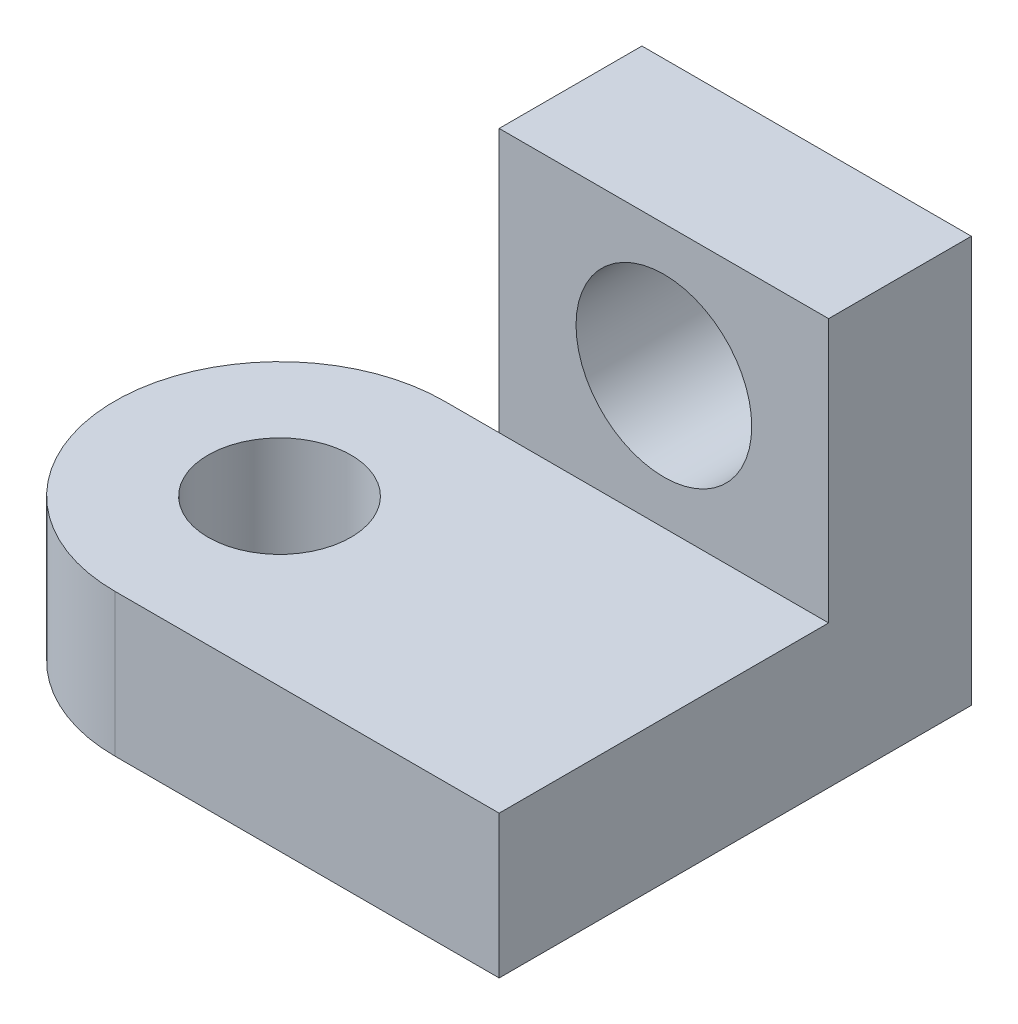
ISO-10303-21;
HEADER;
FILE_DESCRIPTION(('STEP AP214'),'2;1');
FILE_NAME('part.step','',(''),(''),'','','');
FILE_SCHEMA(('AUTOMOTIVE_DESIGN { 1 0 10303 214 1 1 1 1 }'));
ENDSEC;
DATA;
#1=APPLICATION_CONTEXT('core data for automotive mechanical design processes');
#2=APPLICATION_PROTOCOL_DEFINITION('international standard','automotive_design',2000,#1);
#3=PRODUCT_CONTEXT('',#1,'mechanical');
#4=PRODUCT('Part','Part','',(#3));
#5=PRODUCT_RELATED_PRODUCT_CATEGORY('part','',(#4));
#6=PRODUCT_DEFINITION_FORMATION('','',#4);
#7=PRODUCT_DEFINITION_CONTEXT('part definition',#1,'design');
#8=PRODUCT_DEFINITION('design','',#6,#7);
#9=PRODUCT_DEFINITION_SHAPE('','',#8);
#10=(LENGTH_UNIT() NAMED_UNIT(*) SI_UNIT(.MILLI.,.METRE.));
#11=(NAMED_UNIT(*) PLANE_ANGLE_UNIT() SI_UNIT($,.RADIAN.));
#12=(NAMED_UNIT(*) SI_UNIT($,.STERADIAN.) SOLID_ANGLE_UNIT());
#13=UNCERTAINTY_MEASURE_WITH_UNIT(LENGTH_MEASURE(1.E-05),#10,'distance_accuracy_value','');
#14=(GEOMETRIC_REPRESENTATION_CONTEXT(3) GLOBAL_UNCERTAINTY_ASSIGNED_CONTEXT((#13)) GLOBAL_UNIT_ASSIGNED_CONTEXT((#10,
#11,#12)) REPRESENTATION_CONTEXT('',''));
#15=CARTESIAN_POINT('',(0.,0.,0.));
#16=DIRECTION('',(0.,0.,1.));
#17=DIRECTION('',(1.,0.,0.));
#18=AXIS2_PLACEMENT_3D('',#15,#16,#17);
#19=CARTESIAN_POINT('',(-35.,13.,-15.));
#20=DIRECTION('',(0.,1.,0.));
#21=DIRECTION('',(0.,0.,1.));
#22=AXIS2_PLACEMENT_3D('',#19,#20,#21);
#23=PLANE('',#22);
#24=DIRECTION('',(-1.,0.,0.));
#25=VECTOR('',#24,1.);
#26=CARTESIAN_POINT('',(0.,13.,-30.));
#27=LINE('',#26,#25);
#28=CARTESIAN_POINT('',(0.,13.,-30.));
#29=VERTEX_POINT('',#28);
#30=CARTESIAN_POINT('',(-30.,13.,-30.));
#31=VERTEX_POINT('',#30);
#32=EDGE_CURVE('E163',#29,#31,#27,.T.);
#33=ORIENTED_EDGE('',*,*,#32,.T.);
#34=CARTESIAN_POINT('',(-35.,13.,-30.));
#35=VERTEX_POINT('',#34);
#36=EDGE_CURVE('E69',#31,#35,#27,.T.);
#37=ORIENTED_EDGE('',*,*,#36,.T.);
#38=CARTESIAN_POINT('',(-35.,13.,-15.));
#39=DIRECTION('',(0.,1.,0.));
#40=DIRECTION('',(0.,0.,1.));
#41=AXIS2_PLACEMENT_3D('',#38,#39,#40);
#42=CIRCLE('',#41,15.);
#43=CARTESIAN_POINT('',(-35.,13.,0.));
#44=VERTEX_POINT('',#43);
#45=EDGE_CURVE('E165',#35,#44,#42,.T.);
#46=ORIENTED_EDGE('',*,*,#45,.T.);
#47=DIRECTION('',(-1.,0.,0.));
#48=VECTOR('',#47,1.);
#49=CARTESIAN_POINT('',(0.,13.,0.));
#50=LINE('',#49,#48);
#51=CARTESIAN_POINT('',(0.,13.,0.));
#52=VERTEX_POINT('',#51);
#53=EDGE_CURVE('E167',#52,#44,#50,.T.);
#54=ORIENTED_EDGE('',*,*,#53,.F.);
#55=DIRECTION('',(0.,0.,-1.));
#56=VECTOR('',#55,1.);
#57=CARTESIAN_POINT('',(0.,13.,0.));
#58=LINE('',#57,#56);
#59=EDGE_CURVE('E170',#52,#29,#58,.T.);
#60=ORIENTED_EDGE('',*,*,#59,.T.);
#61=EDGE_LOOP('',(#33,#37,#46,#54,#60));
#62=FACE_BOUND('',#61,.T.);
#63=CARTESIAN_POINT('',(-35.,13.,-15.));
#64=DIRECTION('',(0.,1.,0.));
#65=DIRECTION('',(0.,0.,1.));
#66=AXIS2_PLACEMENT_3D('',#63,#64,#65);
#67=CIRCLE('',#66,6.5);
#68=CARTESIAN_POINT('',(-35.,13.,-8.5));
#69=VERTEX_POINT('',#68);
#70=EDGE_CURVE('E157',#69,#69,#67,.T.);
#71=ORIENTED_EDGE('',*,*,#70,.F.);
#72=EDGE_LOOP('',(#71));
#73=FACE_BOUND('',#72,.T.);
#74=ADVANCED_FACE('F54',(#62,#73),#23,.T.);
#75=CARTESIAN_POINT('',(-35.,0.,-15.));
#76=DIRECTION('',(0.,1.,0.));
#77=DIRECTION('',(0.,0.,1.));
#78=AXIS2_PLACEMENT_3D('',#75,#76,#77);
#79=PLANE('',#78);
#80=DIRECTION('',(-1.,0.,0.));
#81=VECTOR('',#80,1.);
#82=CARTESIAN_POINT('',(0.,0.,-30.));
#83=LINE('',#82,#81);
#84=CARTESIAN_POINT('',(-30.,0.,-30.));
#85=VERTEX_POINT('',#84);
#86=CARTESIAN_POINT('',(-35.,0.,-30.));
#87=VERTEX_POINT('',#86);
#88=EDGE_CURVE('E160',#85,#87,#83,.T.);
#89=ORIENTED_EDGE('',*,*,#88,.F.);
#90=DIRECTION('',(0.,0.,-1.));
#91=VECTOR('',#90,1.);
#92=CARTESIAN_POINT('',(-30.,0.,-30.));
#93=LINE('',#92,#91);
#94=CARTESIAN_POINT('',(-30.,0.,-43.));
#95=VERTEX_POINT('',#94);
#96=EDGE_CURVE('E140',#85,#95,#93,.T.);
#97=ORIENTED_EDGE('',*,*,#96,.T.);
#98=DIRECTION('',(-1.,0.,0.));
#99=VECTOR('',#98,1.);
#100=CARTESIAN_POINT('',(0.,0.,-43.));
#101=LINE('',#100,#99);
#102=CARTESIAN_POINT('',(0.,0.,-43.));
#103=VERTEX_POINT('',#102);
#104=EDGE_CURVE('E137',#103,#95,#101,.T.);
#105=ORIENTED_EDGE('',*,*,#104,.F.);
#106=DIRECTION('',(0.,0.,-1.));
#107=VECTOR('',#106,1.);
#108=CARTESIAN_POINT('',(0.,0.,0.));
#109=LINE('',#108,#107);
#110=CARTESIAN_POINT('',(0.,0.,0.));
#111=VERTEX_POINT('',#110);
#112=EDGE_CURVE('E180',#111,#103,#109,.T.);
#113=ORIENTED_EDGE('',*,*,#112,.F.);
#114=DIRECTION('',(-1.,0.,0.));
#115=VECTOR('',#114,1.);
#116=CARTESIAN_POINT('',(0.,0.,0.));
#117=LINE('',#116,#115);
#118=CARTESIAN_POINT('',(-35.,0.,0.));
#119=VERTEX_POINT('',#118);
#120=EDGE_CURVE('E177',#111,#119,#117,.T.);
#121=ORIENTED_EDGE('',*,*,#120,.T.);
#122=CARTESIAN_POINT('',(-35.,0.,-15.));
#123=DIRECTION('',(0.,1.,0.));
#124=DIRECTION('',(0.,0.,1.));
#125=AXIS2_PLACEMENT_3D('',#122,#123,#124);
#126=CIRCLE('',#125,15.);
#127=EDGE_CURVE('E174',#87,#119,#126,.T.);
#128=ORIENTED_EDGE('',*,*,#127,.F.);
#129=EDGE_LOOP('',(#89,#97,#105,#113,#121,#128));
#130=FACE_BOUND('',#129,.T.);
#131=CARTESIAN_POINT('',(-35.,0.,-15.));
#132=DIRECTION('',(0.,1.,0.));
#133=DIRECTION('',(0.,0.,1.));
#134=AXIS2_PLACEMENT_3D('',#131,#132,#133);
#135=CIRCLE('',#134,6.5);
#136=CARTESIAN_POINT('',(-35.,0.,-8.5));
#137=VERTEX_POINT('',#136);
#138=EDGE_CURVE('E152',#137,#137,#135,.T.);
#139=ORIENTED_EDGE('',*,*,#138,.T.);
#140=EDGE_LOOP('',(#139));
#141=FACE_BOUND('',#140,.T.);
#142=ADVANCED_FACE('F193',(#130,#141),#79,.F.);
#143=CARTESIAN_POINT('',(0.,13.,-30.));
#144=DIRECTION('',(0.,0.,1.));
#145=DIRECTION('',(1.,0.,0.));
#146=AXIS2_PLACEMENT_3D('',#143,#144,#145);
#147=PLANE('',#146);
#148=ORIENTED_EDGE('',*,*,#36,.F.);
#149=DIRECTION('',(0.,-1.,0.));
#150=VECTOR('',#149,1.);
#151=CARTESIAN_POINT('',(-30.,37.,-30.));
#152=LINE('',#151,#150);
#153=EDGE_CURVE('E74',#31,#85,#152,.T.);
#154=ORIENTED_EDGE('',*,*,#153,.T.);
#155=ORIENTED_EDGE('',*,*,#88,.T.);
#156=DIRECTION('',(0.,-1.,0.));
#157=VECTOR('',#156,1.);
#158=CARTESIAN_POINT('',(-35.,13.,-30.));
#159=LINE('',#158,#157);
#160=EDGE_CURVE('E12',#35,#87,#159,.T.);
#161=ORIENTED_EDGE('',*,*,#160,.F.);
#162=EDGE_LOOP('',(#148,#154,#155,#161));
#163=FACE_BOUND('',#162,.T.);
#164=ADVANCED_FACE('F56',(#163),#147,.F.);
#165=CARTESIAN_POINT('',(-35.,13.,-15.));
#166=DIRECTION('',(0.,-1.,0.));
#167=DIRECTION('',(0.,0.,-1.));
#168=AXIS2_PLACEMENT_3D('',#165,#166,#167);
#169=CYLINDRICAL_SURFACE('',#168,15.);
#170=ORIENTED_EDGE('',*,*,#127,.T.);
#171=DIRECTION('',(0.,-1.,0.));
#172=VECTOR('',#171,1.);
#173=CARTESIAN_POINT('',(-35.,13.,0.));
#174=LINE('',#173,#172);
#175=EDGE_CURVE('E62',#44,#119,#174,.T.);
#176=ORIENTED_EDGE('',*,*,#175,.F.);
#177=ORIENTED_EDGE('',*,*,#45,.F.);
#178=ORIENTED_EDGE('',*,*,#160,.T.);
#179=EDGE_LOOP('',(#170,#176,#177,#178));
#180=FACE_BOUND('',#179,.T.);
#181=ADVANCED_FACE('F190',(#180),#169,.T.);
#182=CARTESIAN_POINT('',(0.,13.,0.));
#183=DIRECTION('',(0.,0.,1.));
#184=DIRECTION('',(1.,0.,0.));
#185=AXIS2_PLACEMENT_3D('',#182,#183,#184);
#186=PLANE('',#185);
#187=ORIENTED_EDGE('',*,*,#120,.F.);
#188=DIRECTION('',(0.,-1.,0.));
#189=VECTOR('',#188,1.);
#190=CARTESIAN_POINT('',(0.,13.,0.));
#191=LINE('',#190,#189);
#192=EDGE_CURVE('E172',#52,#111,#191,.T.);
#193=ORIENTED_EDGE('',*,*,#192,.F.);
#194=ORIENTED_EDGE('',*,*,#53,.T.);
#195=ORIENTED_EDGE('',*,*,#175,.T.);
#196=EDGE_LOOP('',(#187,#193,#194,#195));
#197=FACE_BOUND('',#196,.T.);
#198=ADVANCED_FACE('F185',(#197),#186,.T.);
#199=CARTESIAN_POINT('',(0.,13.,0.));
#200=DIRECTION('',(-1.,0.,0.));
#201=DIRECTION('',(0.,0.,1.));
#202=AXIS2_PLACEMENT_3D('',#199,#200,#201);
#203=PLANE('',#202);
#204=ORIENTED_EDGE('',*,*,#112,.T.);
#205=DIRECTION('',(0.,-1.,0.));
#206=VECTOR('',#205,1.);
#207=CARTESIAN_POINT('',(0.,37.,-43.));
#208=LINE('',#207,#206);
#209=CARTESIAN_POINT('',(0.,37.,-43.));
#210=VERTEX_POINT('',#209);
#211=EDGE_CURVE('E153',#210,#103,#208,.T.);
#212=ORIENTED_EDGE('',*,*,#211,.F.);
#213=DIRECTION('',(0.,0.,-1.));
#214=VECTOR('',#213,1.);
#215=CARTESIAN_POINT('',(0.,37.,-30.));
#216=LINE('',#215,#214);
#217=CARTESIAN_POINT('',(0.,37.,-30.));
#218=VERTEX_POINT('',#217);
#219=EDGE_CURVE('E147',#218,#210,#216,.T.);
#220=ORIENTED_EDGE('',*,*,#219,.F.);
#221=DIRECTION('',(0.,-1.,0.));
#222=VECTOR('',#221,1.);
#223=CARTESIAN_POINT('',(0.,37.,-30.));
#224=LINE('',#223,#222);
#225=EDGE_CURVE('E135',#218,#29,#224,.T.);
#226=ORIENTED_EDGE('',*,*,#225,.T.);
#227=ORIENTED_EDGE('',*,*,#59,.F.);
#228=ORIENTED_EDGE('',*,*,#192,.T.);
#229=EDGE_LOOP('',(#204,#212,#220,#226,#227,#228));
#230=FACE_BOUND('',#229,.T.);
#231=ADVANCED_FACE('F198',(#230),#203,.F.);
#232=CARTESIAN_POINT('',(-35.,13.,-15.));
#233=DIRECTION('',(0.,-1.,0.));
#234=DIRECTION('',(0.,0.,-1.));
#235=AXIS2_PLACEMENT_3D('',#232,#233,#234);
#236=CYLINDRICAL_SURFACE('',#235,6.5);
#237=ORIENTED_EDGE('',*,*,#70,.T.);
#238=EDGE_LOOP('',(#237));
#239=FACE_BOUND('',#238,.T.);
#240=ORIENTED_EDGE('',*,*,#138,.F.);
#241=EDGE_LOOP('',(#240));
#242=FACE_BOUND('',#241,.T.);
#243=ADVANCED_FACE('F217',(#239,#242),#236,.F.);
#244=CARTESIAN_POINT('',(0.,37.,-30.));
#245=DIRECTION('',(0.,0.,1.));
#246=DIRECTION('',(1.,0.,0.));
#247=AXIS2_PLACEMENT_3D('',#244,#245,#246);
#248=PLANE('',#247);
#249=CARTESIAN_POINT('',(-15.,25.,-30.));
#250=DIRECTION('',(0.,0.,1.));
#251=DIRECTION('',(1.,0.,0.));
#252=AXIS2_PLACEMENT_3D('',#249,#250,#251);
#253=CIRCLE('',#252,8.);
#254=CARTESIAN_POINT('',(-7.,25.,-30.));
#255=VERTEX_POINT('',#254);
#256=EDGE_CURVE('E143',#255,#255,#253,.T.);
#257=ORIENTED_EDGE('',*,*,#256,.F.);
#258=EDGE_LOOP('',(#257));
#259=FACE_BOUND('',#258,.T.);
#260=CARTESIAN_POINT('',(-30.,37.,-30.));
#261=VERTEX_POINT('',#260);
#262=EDGE_CURVE('E115',#261,#31,#152,.T.);
#263=ORIENTED_EDGE('',*,*,#262,.T.);
#264=ORIENTED_EDGE('',*,*,#32,.F.);
#265=ORIENTED_EDGE('',*,*,#225,.F.);
#266=DIRECTION('',(-1.,0.,0.));
#267=VECTOR('',#266,1.);
#268=CARTESIAN_POINT('',(0.,37.,-30.));
#269=LINE('',#268,#267);
#270=EDGE_CURVE('E128',#218,#261,#269,.T.);
#271=ORIENTED_EDGE('',*,*,#270,.T.);
#272=EDGE_LOOP('',(#263,#264,#265,#271));
#273=FACE_BOUND('',#272,.T.);
#274=ADVANCED_FACE('F133',(#259,#273),#248,.T.);
#275=CARTESIAN_POINT('',(0.,37.,-43.));
#276=DIRECTION('',(0.,0.,1.));
#277=DIRECTION('',(1.,0.,0.));
#278=AXIS2_PLACEMENT_3D('',#275,#276,#277);
#279=PLANE('',#278);
#280=CARTESIAN_POINT('',(-15.,25.,-43.));
#281=DIRECTION('',(0.,0.,1.));
#282=DIRECTION('',(1.,0.,0.));
#283=AXIS2_PLACEMENT_3D('',#280,#281,#282);
#284=CIRCLE('',#283,8.);
#285=CARTESIAN_POINT('',(-7.,25.,-43.));
#286=VERTEX_POINT('',#285);
#287=EDGE_CURVE('E300',#286,#286,#284,.T.);
#288=ORIENTED_EDGE('',*,*,#287,.T.);
#289=EDGE_LOOP('',(#288));
#290=FACE_BOUND('',#289,.T.);
#291=ORIENTED_EDGE('',*,*,#104,.T.);
#292=DIRECTION('',(0.,-1.,0.));
#293=VECTOR('',#292,1.);
#294=CARTESIAN_POINT('',(-30.,37.,-43.));
#295=LINE('',#294,#293);
#296=CARTESIAN_POINT('',(-30.,37.,-43.));
#297=VERTEX_POINT('',#296);
#298=EDGE_CURVE('E123',#297,#95,#295,.T.);
#299=ORIENTED_EDGE('',*,*,#298,.F.);
#300=DIRECTION('',(-1.,0.,0.));
#301=VECTOR('',#300,1.);
#302=CARTESIAN_POINT('',(0.,37.,-43.));
#303=LINE('',#302,#301);
#304=EDGE_CURVE('E130',#210,#297,#303,.T.);
#305=ORIENTED_EDGE('',*,*,#304,.F.);
#306=ORIENTED_EDGE('',*,*,#211,.T.);
#307=EDGE_LOOP('',(#291,#299,#305,#306));
#308=FACE_BOUND('',#307,.T.);
#309=ADVANCED_FACE('F201',(#290,#308),#279,.F.);
#310=CARTESIAN_POINT('',(-30.,37.,-30.));
#311=DIRECTION('',(-1.,0.,0.));
#312=DIRECTION('',(0.,0.,1.));
#313=AXIS2_PLACEMENT_3D('',#310,#311,#312);
#314=PLANE('',#313);
#315=ORIENTED_EDGE('',*,*,#96,.F.);
#316=ORIENTED_EDGE('',*,*,#153,.F.);
#317=ORIENTED_EDGE('',*,*,#262,.F.);
#318=DIRECTION('',(0.,0.,-1.));
#319=VECTOR('',#318,1.);
#320=CARTESIAN_POINT('',(-30.,37.,-30.));
#321=LINE('',#320,#319);
#322=EDGE_CURVE('E119',#261,#297,#321,.T.);
#323=ORIENTED_EDGE('',*,*,#322,.T.);
#324=ORIENTED_EDGE('',*,*,#298,.T.);
#325=EDGE_LOOP('',(#315,#316,#317,#323,#324));
#326=FACE_BOUND('',#325,.T.);
#327=ADVANCED_FACE('F118',(#326),#314,.T.);
#328=CARTESIAN_POINT('',(0.,37.,0.));
#329=DIRECTION('',(0.,-1.,0.));
#330=DIRECTION('',(0.,0.,-1.));
#331=AXIS2_PLACEMENT_3D('',#328,#329,#330);
#332=PLANE('',#331);
#333=ORIENTED_EDGE('',*,*,#270,.F.);
#334=ORIENTED_EDGE('',*,*,#219,.T.);
#335=ORIENTED_EDGE('',*,*,#304,.T.);
#336=ORIENTED_EDGE('',*,*,#322,.F.);
#337=EDGE_LOOP('',(#333,#334,#335,#336));
#338=FACE_BOUND('',#337,.T.);
#339=ADVANCED_FACE('F127',(#338),#332,.F.);
#340=CARTESIAN_POINT('',(-15.,25.,-43.));
#341=DIRECTION('',(0.,0.,1.));
#342=DIRECTION('',(1.,0.,0.));
#343=AXIS2_PLACEMENT_3D('',#340,#341,#342);
#344=CYLINDRICAL_SURFACE('',#343,8.);
#345=ORIENTED_EDGE('',*,*,#256,.T.);
#346=EDGE_LOOP('',(#345));
#347=FACE_BOUND('',#346,.T.);
#348=ORIENTED_EDGE('',*,*,#287,.F.);
#349=EDGE_LOOP('',(#348));
#350=FACE_BOUND('',#349,.T.);
#351=ADVANCED_FACE('F284',(#347,#350),#344,.F.);
#352=CLOSED_SHELL('',(#74,#142,#164,#181,#198,#231,#243,#274,#309,#327,#339,#351));
#353=MANIFOLD_SOLID_BREP('B2',#352);
#354=ADVANCED_BREP_SHAPE_REPRESENTATION('',(#18,#353),#14);
#355=SHAPE_DEFINITION_REPRESENTATION(#9,#354);
ENDSEC;
END-ISO-10303-21;
